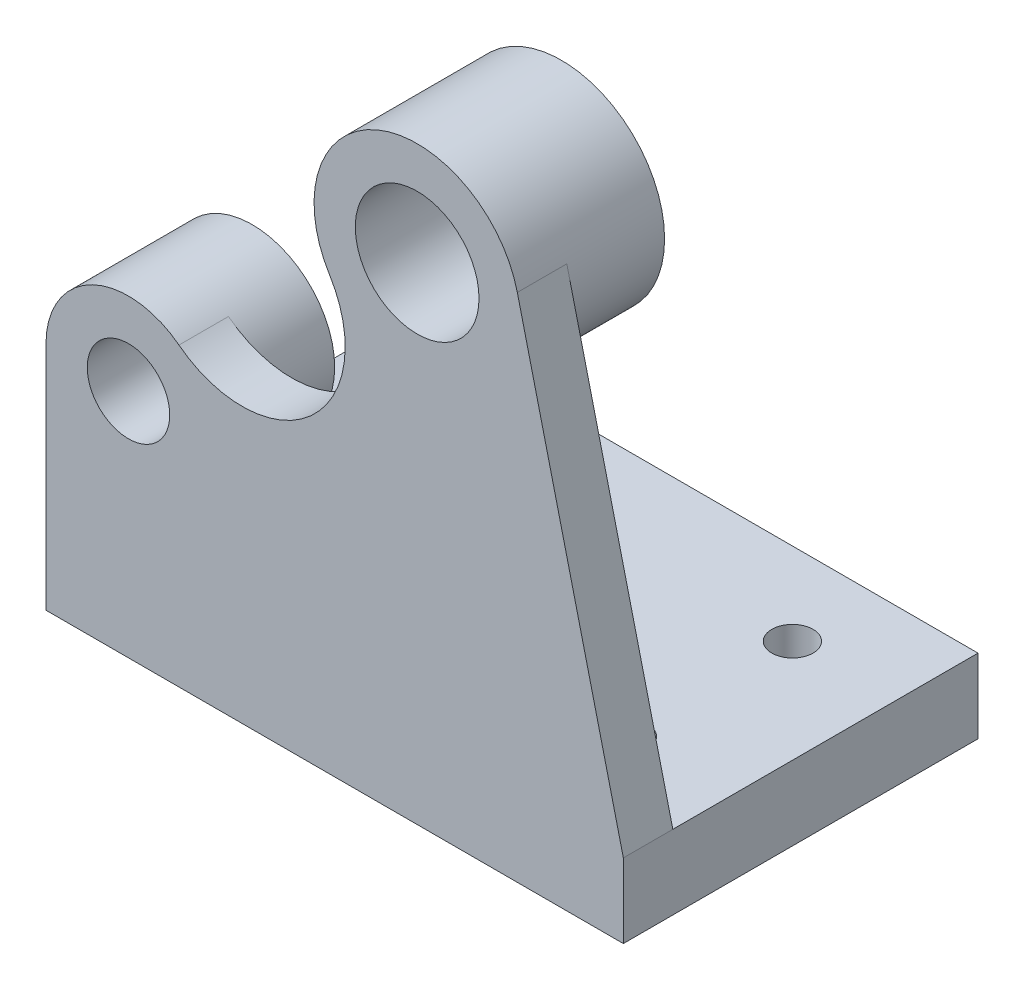
ISO-10303-21;
HEADER;
FILE_DESCRIPTION(('STEP AP214'),'2;1');
FILE_NAME('part.step','',(''),(''),'','','');
FILE_SCHEMA(('AUTOMOTIVE_DESIGN { 1 0 10303 214 1 1 1 1 }'));
ENDSEC;
DATA;
#1=APPLICATION_CONTEXT('core data for automotive mechanical design processes');
#2=APPLICATION_PROTOCOL_DEFINITION('international standard','automotive_design',2000,#1);
#3=PRODUCT_CONTEXT('',#1,'mechanical');
#4=PRODUCT('Part','Part','',(#3));
#5=PRODUCT_RELATED_PRODUCT_CATEGORY('part','',(#4));
#6=PRODUCT_DEFINITION_FORMATION('','',#4);
#7=PRODUCT_DEFINITION_CONTEXT('part definition',#1,'design');
#8=PRODUCT_DEFINITION('design','',#6,#7);
#9=PRODUCT_DEFINITION_SHAPE('','',#8);
#10=(LENGTH_UNIT() NAMED_UNIT(*) SI_UNIT(.MILLI.,.METRE.));
#11=(NAMED_UNIT(*) PLANE_ANGLE_UNIT() SI_UNIT($,.RADIAN.));
#12=(NAMED_UNIT(*) SI_UNIT($,.STERADIAN.) SOLID_ANGLE_UNIT());
#13=UNCERTAINTY_MEASURE_WITH_UNIT(LENGTH_MEASURE(1.E-05),#10,'distance_accuracy_value','');
#14=(GEOMETRIC_REPRESENTATION_CONTEXT(3) GLOBAL_UNCERTAINTY_ASSIGNED_CONTEXT((#13)) GLOBAL_UNIT_ASSIGNED_CONTEXT((#10,
#11,#12)) REPRESENTATION_CONTEXT('',''));
#15=CARTESIAN_POINT('',(0.,0.,0.));
#16=DIRECTION('',(0.,0.,1.));
#17=DIRECTION('',(1.,0.,0.));
#18=AXIS2_PLACEMENT_3D('',#15,#16,#17);
#19=CARTESIAN_POINT('',(45.,30.,17.));
#20=DIRECTION('',(0.,-1.,0.));
#21=DIRECTION('',(0.,0.,-1.));
#22=AXIS2_PLACEMENT_3D('',#19,#20,#21);
#23=CYLINDRICAL_SURFACE('',#22,5.);
#24=CARTESIAN_POINT('',(45.,18.,17.));
#25=DIRECTION('',(0.,1.,0.));
#26=DIRECTION('',(0.,0.,1.));
#27=AXIS2_PLACEMENT_3D('',#24,#25,#26);
#28=CIRCLE('',#27,5.);
#29=CARTESIAN_POINT('',(45.,18.,22.));
#30=VERTEX_POINT('',#29);
#31=EDGE_CURVE('E42',#30,#30,#28,.T.);
#32=ORIENTED_EDGE('',*,*,#31,.T.);
#33=EDGE_LOOP('',(#32));
#34=FACE_BOUND('',#33,.T.);
#35=CARTESIAN_POINT('',(45.,0.,17.));
#36=DIRECTION('',(0.,-1.,0.));
#37=DIRECTION('',(0.,0.,-1.));
#38=AXIS2_PLACEMENT_3D('',#35,#36,#37);
#39=CIRCLE('',#38,5.);
#40=CARTESIAN_POINT('',(45.,0.,12.));
#41=VERTEX_POINT('',#40);
#42=EDGE_CURVE('E11',#41,#41,#39,.T.);
#43=ORIENTED_EDGE('',*,*,#42,.T.);
#44=EDGE_LOOP('',(#43));
#45=FACE_BOUND('',#44,.T.);
#46=ADVANCED_FACE('F35',(#34,#45),#23,.F.);
#47=CARTESIAN_POINT('',(-55.,30.,17.));
#48=DIRECTION('',(0.,-1.,0.));
#49=DIRECTION('',(0.,0.,-1.));
#50=AXIS2_PLACEMENT_3D('',#47,#48,#49);
#51=CYLINDRICAL_SURFACE('',#50,5.);
#52=CARTESIAN_POINT('',(-55.,18.,17.));
#53=DIRECTION('',(0.,1.,0.));
#54=DIRECTION('',(0.,0.,1.));
#55=AXIS2_PLACEMENT_3D('',#52,#53,#54);
#56=CIRCLE('',#55,5.);
#57=CARTESIAN_POINT('',(-55.,18.,22.));
#58=VERTEX_POINT('',#57);
#59=EDGE_CURVE('E175',#58,#58,#56,.T.);
#60=ORIENTED_EDGE('',*,*,#59,.T.);
#61=EDGE_LOOP('',(#60));
#62=FACE_BOUND('',#61,.T.);
#63=CARTESIAN_POINT('',(-55.,0.,17.));
#64=DIRECTION('',(0.,-1.,0.));
#65=DIRECTION('',(0.,0.,-1.));
#66=AXIS2_PLACEMENT_3D('',#63,#64,#65);
#67=CIRCLE('',#66,5.);
#68=CARTESIAN_POINT('',(-55.,0.,12.));
#69=VERTEX_POINT('',#68);
#70=EDGE_CURVE('E178',#69,#69,#67,.T.);
#71=ORIENTED_EDGE('',*,*,#70,.T.);
#72=EDGE_LOOP('',(#71));
#73=FACE_BOUND('',#72,.T.);
#74=ADVANCED_FACE('F203',(#62,#73),#51,.F.);
#75=CARTESIAN_POINT('',(70.,18.,-43.));
#76=DIRECTION('',(-1.,0.,0.));
#77=DIRECTION('',(0.,0.,1.));
#78=AXIS2_PLACEMENT_3D('',#75,#76,#77);
#79=PLANE('',#78);
#80=DIRECTION('',(0.,0.,-1.));
#81=VECTOR('',#80,1.);
#82=CARTESIAN_POINT('',(70.,0.,-43.));
#83=LINE('',#82,#81);
#84=CARTESIAN_POINT('',(70.,0.,43.));
#85=VERTEX_POINT('',#84);
#86=CARTESIAN_POINT('',(70.,0.,-43.));
#87=VERTEX_POINT('',#86);
#88=EDGE_CURVE('E149',#85,#87,#83,.T.);
#89=ORIENTED_EDGE('',*,*,#88,.T.);
#90=DIRECTION('',(0.,-1.,0.));
#91=VECTOR('',#90,1.);
#92=CARTESIAN_POINT('',(70.,18.,-43.));
#93=LINE('',#92,#91);
#94=CARTESIAN_POINT('',(70.,18.,-43.));
#95=VERTEX_POINT('',#94);
#96=EDGE_CURVE('E172',#95,#87,#93,.T.);
#97=ORIENTED_EDGE('',*,*,#96,.F.);
#98=DIRECTION('',(0.,0.,-1.));
#99=VECTOR('',#98,1.);
#100=CARTESIAN_POINT('',(70.,18.,-43.));
#101=LINE('',#100,#99);
#102=CARTESIAN_POINT('',(70.,18.,31.));
#103=VERTEX_POINT('',#102);
#104=EDGE_CURVE('E78',#103,#95,#101,.T.);
#105=ORIENTED_EDGE('',*,*,#104,.F.);
#106=CARTESIAN_POINT('',(70.,18.,43.));
#107=VERTEX_POINT('',#106);
#108=EDGE_CURVE('E152',#107,#103,#101,.T.);
#109=ORIENTED_EDGE('',*,*,#108,.F.);
#110=DIRECTION('',(0.,-1.,0.));
#111=VECTOR('',#110,1.);
#112=CARTESIAN_POINT('',(70.,18.,43.));
#113=LINE('',#112,#111);
#114=EDGE_CURVE('E58',#107,#85,#113,.T.);
#115=ORIENTED_EDGE('',*,*,#114,.T.);
#116=EDGE_LOOP('',(#89,#97,#105,#109,#115));
#117=FACE_BOUND('',#116,.T.);
#118=ADVANCED_FACE('F207',(#117),#79,.F.);
#119=CARTESIAN_POINT('',(-70.,18.,-43.));
#120=DIRECTION('',(0.,0.,1.));
#121=DIRECTION('',(1.,0.,0.));
#122=AXIS2_PLACEMENT_3D('',#119,#120,#121);
#123=PLANE('',#122);
#124=DIRECTION('',(-1.,0.,0.));
#125=VECTOR('',#124,1.);
#126=CARTESIAN_POINT('',(-70.,0.,-43.));
#127=LINE('',#126,#125);
#128=CARTESIAN_POINT('',(-70.,0.,-43.));
#129=VERTEX_POINT('',#128);
#130=EDGE_CURVE('E161',#87,#129,#127,.T.);
#131=ORIENTED_EDGE('',*,*,#130,.T.);
#132=DIRECTION('',(0.,-1.,0.));
#133=VECTOR('',#132,1.);
#134=CARTESIAN_POINT('',(-70.,18.,-43.));
#135=LINE('',#134,#133);
#136=CARTESIAN_POINT('',(-70.,18.,-43.));
#137=VERTEX_POINT('',#136);
#138=EDGE_CURVE('E169',#137,#129,#135,.T.);
#139=ORIENTED_EDGE('',*,*,#138,.F.);
#140=DIRECTION('',(-1.,0.,0.));
#141=VECTOR('',#140,1.);
#142=CARTESIAN_POINT('',(-70.,18.,-43.));
#143=LINE('',#142,#141);
#144=EDGE_CURVE('E155',#95,#137,#143,.T.);
#145=ORIENTED_EDGE('',*,*,#144,.F.);
#146=ORIENTED_EDGE('',*,*,#96,.T.);
#147=EDGE_LOOP('',(#131,#139,#145,#146));
#148=FACE_BOUND('',#147,.T.);
#149=ADVANCED_FACE('F212',(#148),#123,.F.);
#150=CARTESIAN_POINT('',(-70.,18.,-43.));
#151=DIRECTION('',(1.,0.,0.));
#152=DIRECTION('',(0.,0.,-1.));
#153=AXIS2_PLACEMENT_3D('',#150,#151,#152);
#154=PLANE('',#153);
#155=DIRECTION('',(0.,0.,1.));
#156=VECTOR('',#155,1.);
#157=CARTESIAN_POINT('',(-70.,0.,-43.));
#158=LINE('',#157,#156);
#159=CARTESIAN_POINT('',(-70.,0.,43.));
#160=VERTEX_POINT('',#159);
#161=EDGE_CURVE('E163',#129,#160,#158,.T.);
#162=ORIENTED_EDGE('',*,*,#161,.T.);
#163=DIRECTION('',(0.,-1.,0.));
#164=VECTOR('',#163,1.);
#165=CARTESIAN_POINT('',(-70.,18.,43.));
#166=LINE('',#165,#164);
#167=CARTESIAN_POINT('',(-70.,56.,43.));
#168=VERTEX_POINT('',#167);
#169=EDGE_CURVE('E167',#168,#160,#166,.T.);
#170=ORIENTED_EDGE('',*,*,#169,.F.);
#171=DIRECTION('',(0.,0.,1.));
#172=VECTOR('',#171,1.);
#173=CARTESIAN_POINT('',(-70.,56.,31.));
#174=LINE('',#173,#172);
#175=CARTESIAN_POINT('',(-70.,56.,31.));
#176=VERTEX_POINT('',#175);
#177=EDGE_CURVE('E114',#176,#168,#174,.T.);
#178=ORIENTED_EDGE('',*,*,#177,.F.);
#179=DIRECTION('',(0.,-1.,0.));
#180=VECTOR('',#179,1.);
#181=CARTESIAN_POINT('',(-70.,0.,31.));
#182=LINE('',#181,#180);
#183=CARTESIAN_POINT('',(-70.,18.,31.));
#184=VERTEX_POINT('',#183);
#185=EDGE_CURVE('E247',#176,#184,#182,.T.);
#186=ORIENTED_EDGE('',*,*,#185,.T.);
#187=DIRECTION('',(0.,0.,1.));
#188=VECTOR('',#187,1.);
#189=CARTESIAN_POINT('',(-70.,18.,-43.));
#190=LINE('',#189,#188);
#191=EDGE_CURVE('E157',#137,#184,#190,.T.);
#192=ORIENTED_EDGE('',*,*,#191,.F.);
#193=ORIENTED_EDGE('',*,*,#138,.T.);
#194=EDGE_LOOP('',(#162,#170,#178,#186,#192,#193));
#195=FACE_BOUND('',#194,.T.);
#196=ADVANCED_FACE('F197',(#195),#154,.F.);
#197=CARTESIAN_POINT('',(-70.,18.,43.));
#198=DIRECTION('',(0.,0.,-1.));
#199=DIRECTION('',(-1.,0.,0.));
#200=AXIS2_PLACEMENT_3D('',#197,#198,#199);
#201=PLANE('',#200);
#202=DIRECTION('',(1.,0.,0.));
#203=VECTOR('',#202,1.);
#204=CARTESIAN_POINT('',(-70.,0.,43.));
#205=LINE('',#204,#203);
#206=EDGE_CURVE('E77',#160,#85,#205,.T.);
#207=ORIENTED_EDGE('',*,*,#206,.T.);
#208=ORIENTED_EDGE('',*,*,#114,.F.);
#209=DIRECTION('',(-0.235889894354067,0.971779788708135,0.));
#210=VECTOR('',#209,1.);
#211=CARTESIAN_POINT('',(70.2311116124019,17.0479049792153,43.));
#212=LINE('',#211,#210);
#213=CARTESIAN_POINT('',(44.2944947177034,123.897247358852,43.));
#214=VERTEX_POINT('',#213);
#215=EDGE_CURVE('E134',#107,#214,#212,.T.);
#216=ORIENTED_EDGE('',*,*,#215,.T.);
#217=CARTESIAN_POINT('',(20.,118.,43.));
#218=DIRECTION('',(0.,0.,1.));
#219=DIRECTION('',(1.,0.,0.));
#220=AXIS2_PLACEMENT_3D('',#217,#218,#219);
#221=CIRCLE('',#220,25.);
#222=CARTESIAN_POINT('',(-1.22530085264707,104.790662252989,43.));
#223=VERTEX_POINT('',#222);
#224=EDGE_CURVE('E133',#214,#223,#221,.T.);
#225=ORIENTED_EDGE('',*,*,#224,.T.);
#226=CARTESIAN_POINT('',(-22.4506017052942,91.5813245059772,43.));
#227=DIRECTION('',(0.,0.,1.));
#228=DIRECTION('',(1.,0.,0.));
#229=AXIS2_PLACEMENT_3D('',#226,#227,#228);
#230=CIRCLE('',#229,25.);
#231=CARTESIAN_POINT('',(-37.7558229801307,71.8139220026566,43.));
#232=VERTEX_POINT('',#231);
#233=EDGE_CURVE('E125',#223,#232,#230,.F.);
#234=ORIENTED_EDGE('',*,*,#233,.T.);
#235=CARTESIAN_POINT('',(-50.,56.,43.));
#236=DIRECTION('',(0.,0.,1.));
#237=DIRECTION('',(1.,0.,0.));
#238=AXIS2_PLACEMENT_3D('',#235,#236,#237);
#239=CIRCLE('',#238,20.);
#240=EDGE_CURVE('E107',#232,#168,#239,.T.);
#241=ORIENTED_EDGE('',*,*,#240,.T.);
#242=ORIENTED_EDGE('',*,*,#169,.T.);
#243=EDGE_LOOP('',(#207,#208,#216,#225,#234,#241,#242));
#244=FACE_BOUND('',#243,.T.);
#245=CARTESIAN_POINT('',(20.,118.,43.));
#246=DIRECTION('',(0.,0.,1.));
#247=DIRECTION('',(1.,0.,0.));
#248=AXIS2_PLACEMENT_3D('',#245,#246,#247);
#249=CIRCLE('',#248,15.);
#250=CARTESIAN_POINT('',(35.,118.,43.));
#251=VERTEX_POINT('',#250);
#252=EDGE_CURVE('E252',#251,#251,#249,.T.);
#253=ORIENTED_EDGE('',*,*,#252,.F.);
#254=EDGE_LOOP('',(#253));
#255=FACE_BOUND('',#254,.T.);
#256=CARTESIAN_POINT('',(-50.,56.,43.));
#257=DIRECTION('',(0.,0.,1.));
#258=DIRECTION('',(1.,0.,0.));
#259=AXIS2_PLACEMENT_3D('',#256,#257,#258);
#260=CIRCLE('',#259,10.);
#261=CARTESIAN_POINT('',(-40.,56.,43.));
#262=VERTEX_POINT('',#261);
#263=EDGE_CURVE('E118',#262,#262,#260,.T.);
#264=ORIENTED_EDGE('',*,*,#263,.F.);
#265=EDGE_LOOP('',(#264));
#266=FACE_BOUND('',#265,.T.);
#267=ADVANCED_FACE('F131',(#244,#255,#266),#201,.F.);
#268=CARTESIAN_POINT('',(0.,18.,0.));
#269=DIRECTION('',(0.,1.,0.));
#270=DIRECTION('',(0.,0.,1.));
#271=AXIS2_PLACEMENT_3D('',#268,#269,#270);
#272=PLANE('',#271);
#273=CARTESIAN_POINT('',(45.,18.,-23.));
#274=DIRECTION('',(0.,1.,0.));
#275=DIRECTION('',(0.,0.,1.));
#276=AXIS2_PLACEMENT_3D('',#273,#274,#275);
#277=CIRCLE('',#276,5.);
#278=CARTESIAN_POINT('',(45.,18.,-18.));
#279=VERTEX_POINT('',#278);
#280=EDGE_CURVE('E273',#279,#279,#277,.T.);
#281=ORIENTED_EDGE('',*,*,#280,.F.);
#282=EDGE_LOOP('',(#281));
#283=FACE_BOUND('',#282,.T.);
#284=CARTESIAN_POINT('',(-55.,18.,-23.));
#285=DIRECTION('',(0.,1.,0.));
#286=DIRECTION('',(0.,0.,1.));
#287=AXIS2_PLACEMENT_3D('',#284,#285,#286);
#288=CIRCLE('',#287,5.);
#289=CARTESIAN_POINT('',(-55.,18.,-18.));
#290=VERTEX_POINT('',#289);
#291=EDGE_CURVE('E260',#290,#290,#288,.T.);
#292=ORIENTED_EDGE('',*,*,#291,.F.);
#293=EDGE_LOOP('',(#292));
#294=FACE_BOUND('',#293,.T.);
#295=DIRECTION('',(-1.,0.,0.));
#296=VECTOR('',#295,1.);
#297=CARTESIAN_POINT('',(0.,18.,31.));
#298=LINE('',#297,#296);
#299=EDGE_CURVE('E49',#103,#184,#298,.T.);
#300=ORIENTED_EDGE('',*,*,#299,.F.);
#301=ORIENTED_EDGE('',*,*,#104,.T.);
#302=ORIENTED_EDGE('',*,*,#144,.T.);
#303=ORIENTED_EDGE('',*,*,#191,.T.);
#304=EDGE_LOOP('',(#300,#301,#302,#303));
#305=FACE_BOUND('',#304,.T.);
#306=ORIENTED_EDGE('',*,*,#59,.F.);
#307=EDGE_LOOP('',(#306));
#308=FACE_BOUND('',#307,.T.);
#309=ORIENTED_EDGE('',*,*,#31,.F.);
#310=EDGE_LOOP('',(#309));
#311=FACE_BOUND('',#310,.T.);
#312=ADVANCED_FACE('F185',(#283,#294,#305,#308,#311),#272,.T.);
#313=CARTESIAN_POINT('',(0.,0.,0.));
#314=DIRECTION('',(0.,1.,0.));
#315=DIRECTION('',(0.,0.,1.));
#316=AXIS2_PLACEMENT_3D('',#313,#314,#315);
#317=PLANE('',#316);
#318=CARTESIAN_POINT('',(45.,0.,-23.));
#319=DIRECTION('',(0.,-1.,0.));
#320=DIRECTION('',(0.,0.,-1.));
#321=AXIS2_PLACEMENT_3D('',#318,#319,#320);
#322=CIRCLE('',#321,5.);
#323=CARTESIAN_POINT('',(45.,0.,-28.));
#324=VERTEX_POINT('',#323);
#325=EDGE_CURVE('E270',#324,#324,#322,.T.);
#326=ORIENTED_EDGE('',*,*,#325,.F.);
#327=EDGE_LOOP('',(#326));
#328=FACE_BOUND('',#327,.T.);
#329=CARTESIAN_POINT('',(-55.,0.,-23.));
#330=DIRECTION('',(0.,-1.,0.));
#331=DIRECTION('',(0.,0.,-1.));
#332=AXIS2_PLACEMENT_3D('',#329,#330,#331);
#333=CIRCLE('',#332,5.);
#334=CARTESIAN_POINT('',(-55.,0.,-28.));
#335=VERTEX_POINT('',#334);
#336=EDGE_CURVE('E267',#335,#335,#333,.T.);
#337=ORIENTED_EDGE('',*,*,#336,.F.);
#338=EDGE_LOOP('',(#337));
#339=FACE_BOUND('',#338,.T.);
#340=ORIENTED_EDGE('',*,*,#88,.F.);
#341=ORIENTED_EDGE('',*,*,#206,.F.);
#342=ORIENTED_EDGE('',*,*,#161,.F.);
#343=ORIENTED_EDGE('',*,*,#130,.F.);
#344=EDGE_LOOP('',(#340,#341,#342,#343));
#345=FACE_BOUND('',#344,.T.);
#346=ORIENTED_EDGE('',*,*,#70,.F.);
#347=EDGE_LOOP('',(#346));
#348=FACE_BOUND('',#347,.T.);
#349=ORIENTED_EDGE('',*,*,#42,.F.);
#350=EDGE_LOOP('',(#349));
#351=FACE_BOUND('',#350,.T.);
#352=ADVANCED_FACE('F187',(#328,#339,#345,#348,#351),#317,.F.);
#353=CARTESIAN_POINT('',(70.2311116124019,17.0479049792153,31.));
#354=DIRECTION('',(0.971779788708135,0.235889894354067,0.));
#355=DIRECTION('',(-0.235889894354067,0.971779788708135,0.));
#356=AXIS2_PLACEMENT_3D('',#353,#354,#355);
#357=PLANE('',#356);
#358=ORIENTED_EDGE('',*,*,#215,.F.);
#359=ORIENTED_EDGE('',*,*,#108,.T.);
#360=DIRECTION('',(-0.235889894354067,0.971779788708135,0.));
#361=VECTOR('',#360,1.);
#362=CARTESIAN_POINT('',(70.2311116124019,17.0479049792153,31.));
#363=LINE('',#362,#361);
#364=CARTESIAN_POINT('',(44.2944947177034,123.897247358852,31.));
#365=VERTEX_POINT('',#364);
#366=EDGE_CURVE('E143',#103,#365,#363,.T.);
#367=ORIENTED_EDGE('',*,*,#366,.T.);
#368=DIRECTION('',(0.,0.,1.));
#369=VECTOR('',#368,1.);
#370=CARTESIAN_POINT('',(44.2944947177034,123.897247358852,31.));
#371=LINE('',#370,#369);
#372=EDGE_CURVE('E146',#365,#214,#371,.T.);
#373=ORIENTED_EDGE('',*,*,#372,.T.);
#374=EDGE_LOOP('',(#358,#359,#367,#373));
#375=FACE_BOUND('',#374,.T.);
#376=ADVANCED_FACE('F194',(#375),#357,.T.);
#377=CARTESIAN_POINT('',(-22.4506017052942,91.5813245059772,31.));
#378=DIRECTION('',(0.,0.,1.));
#379=DIRECTION('',(1.,0.,0.));
#380=AXIS2_PLACEMENT_3D('',#377,#378,#379);
#381=CYLINDRICAL_SURFACE('',#380,25.);
#382=ORIENTED_EDGE('',*,*,#233,.F.);
#383=DIRECTION('',(0.,0.,1.));
#384=VECTOR('',#383,1.);
#385=CARTESIAN_POINT('',(-1.22530085264707,104.790662252989,31.));
#386=LINE('',#385,#384);
#387=CARTESIAN_POINT('',(-1.22530085264706,104.790662252989,31.));
#388=VERTEX_POINT('',#387);
#389=EDGE_CURVE('E128',#388,#223,#386,.T.);
#390=ORIENTED_EDGE('',*,*,#389,.F.);
#391=CARTESIAN_POINT('',(-22.4506017052942,91.5813245059772,31.));
#392=DIRECTION('',(0.,0.,1.));
#393=DIRECTION('',(1.,0.,0.));
#394=AXIS2_PLACEMENT_3D('',#391,#392,#393);
#395=CIRCLE('',#394,25.);
#396=CARTESIAN_POINT('',(-37.7558229801307,71.8139220026566,31.));
#397=VERTEX_POINT('',#396);
#398=EDGE_CURVE('E127',#388,#397,#395,.F.);
#399=ORIENTED_EDGE('',*,*,#398,.T.);
#400=DIRECTION('',(0.,0.,1.));
#401=VECTOR('',#400,1.);
#402=CARTESIAN_POINT('',(-37.7558229801307,71.8139220026566,31.));
#403=LINE('',#402,#401);
#404=EDGE_CURVE('E111',#397,#232,#403,.T.);
#405=ORIENTED_EDGE('',*,*,#404,.T.);
#406=EDGE_LOOP('',(#382,#390,#399,#405));
#407=FACE_BOUND('',#406,.T.);
#408=ADVANCED_FACE('F123',(#407),#381,.F.);
#409=CARTESIAN_POINT('',(0.,0.,31.));
#410=DIRECTION('',(0.,0.,1.));
#411=DIRECTION('',(1.,0.,0.));
#412=AXIS2_PLACEMENT_3D('',#409,#410,#411);
#413=PLANE('',#412);
#414=CARTESIAN_POINT('',(20.,118.,31.));
#415=DIRECTION('',(0.,0.,1.));
#416=DIRECTION('',(1.,0.,0.));
#417=AXIS2_PLACEMENT_3D('',#414,#415,#416);
#418=CIRCLE('',#417,25.);
#419=EDGE_CURVE('E137',#388,#365,#418,.T.);
#420=ORIENTED_EDGE('',*,*,#419,.T.);
#421=ORIENTED_EDGE('',*,*,#366,.F.);
#422=ORIENTED_EDGE('',*,*,#299,.T.);
#423=ORIENTED_EDGE('',*,*,#185,.F.);
#424=CARTESIAN_POINT('',(-50.,56.,31.));
#425=DIRECTION('',(0.,0.,1.));
#426=DIRECTION('',(1.,0.,0.));
#427=AXIS2_PLACEMENT_3D('',#424,#425,#426);
#428=CIRCLE('',#427,20.);
#429=EDGE_CURVE('E241',#176,#397,#428,.T.);
#430=ORIENTED_EDGE('',*,*,#429,.T.);
#431=ORIENTED_EDGE('',*,*,#398,.F.);
#432=EDGE_LOOP('',(#420,#421,#422,#423,#430,#431));
#433=FACE_BOUND('',#432,.T.);
#434=ADVANCED_FACE('F239',(#433),#413,.F.);
#435=CARTESIAN_POINT('',(20.,118.,7.99999999999999));
#436=DIRECTION('',(0.,0.,1.));
#437=DIRECTION('',(1.,0.,0.));
#438=AXIS2_PLACEMENT_3D('',#435,#436,#437);
#439=CYLINDRICAL_SURFACE('',#438,25.);
#440=CARTESIAN_POINT('',(20.,118.,7.99999999999999));
#441=DIRECTION('',(0.,0.,1.));
#442=DIRECTION('',(1.,0.,0.));
#443=AXIS2_PLACEMENT_3D('',#440,#441,#442);
#444=CIRCLE('',#443,25.);
#445=CARTESIAN_POINT('',(45.,118.,7.99999999999999));
#446=VERTEX_POINT('',#445);
#447=EDGE_CURVE('E135',#446,#446,#444,.T.);
#448=ORIENTED_EDGE('',*,*,#447,.T.);
#449=EDGE_LOOP('',(#448));
#450=FACE_BOUND('',#449,.T.);
#451=ORIENTED_EDGE('',*,*,#372,.F.);
#452=ORIENTED_EDGE('',*,*,#419,.F.);
#453=ORIENTED_EDGE('',*,*,#389,.T.);
#454=ORIENTED_EDGE('',*,*,#224,.F.);
#455=EDGE_LOOP('',(#451,#452,#453,#454));
#456=FACE_BOUND('',#455,.T.);
#457=ADVANCED_FACE('F237',(#450,#456),#439,.T.);
#458=CARTESIAN_POINT('',(20.,118.,7.99999999999999));
#459=DIRECTION('',(0.,0.,1.));
#460=DIRECTION('',(1.,0.,0.));
#461=AXIS2_PLACEMENT_3D('',#458,#459,#460);
#462=CYLINDRICAL_SURFACE('',#461,15.);
#463=CARTESIAN_POINT('',(20.,118.,7.99999999999999));
#464=DIRECTION('',(0.,0.,1.));
#465=DIRECTION('',(1.,0.,0.));
#466=AXIS2_PLACEMENT_3D('',#463,#464,#465);
#467=CIRCLE('',#466,15.);
#468=CARTESIAN_POINT('',(35.,118.,7.99999999999999));
#469=VERTEX_POINT('',#468);
#470=EDGE_CURVE('E140',#469,#469,#467,.T.);
#471=ORIENTED_EDGE('',*,*,#470,.F.);
#472=EDGE_LOOP('',(#471));
#473=FACE_BOUND('',#472,.T.);
#474=ORIENTED_EDGE('',*,*,#252,.T.);
#475=EDGE_LOOP('',(#474));
#476=FACE_BOUND('',#475,.T.);
#477=ADVANCED_FACE('F304',(#473,#476),#462,.F.);
#478=CARTESIAN_POINT('',(0.,0.,7.99999999999999));
#479=DIRECTION('',(0.,0.,1.));
#480=DIRECTION('',(1.,0.,0.));
#481=AXIS2_PLACEMENT_3D('',#478,#479,#480);
#482=PLANE('',#481);
#483=ORIENTED_EDGE('',*,*,#470,.T.);
#484=EDGE_LOOP('',(#483));
#485=FACE_BOUND('',#484,.T.);
#486=ORIENTED_EDGE('',*,*,#447,.F.);
#487=EDGE_LOOP('',(#486));
#488=FACE_BOUND('',#487,.T.);
#489=ADVANCED_FACE('F300',(#485,#488),#482,.F.);
#490=CARTESIAN_POINT('',(-50.,56.,13.));
#491=DIRECTION('',(0.,0.,1.));
#492=DIRECTION('',(1.,0.,0.));
#493=AXIS2_PLACEMENT_3D('',#490,#491,#492);
#494=CYLINDRICAL_SURFACE('',#493,10.);
#495=CARTESIAN_POINT('',(-50.,56.,13.));
#496=DIRECTION('',(0.,0.,1.));
#497=DIRECTION('',(1.,0.,0.));
#498=AXIS2_PLACEMENT_3D('',#495,#496,#497);
#499=CIRCLE('',#498,10.);
#500=CARTESIAN_POINT('',(-40.,56.,13.));
#501=VERTEX_POINT('',#500);
#502=EDGE_CURVE('E117',#501,#501,#499,.T.);
#503=ORIENTED_EDGE('',*,*,#502,.F.);
#504=EDGE_LOOP('',(#503));
#505=FACE_BOUND('',#504,.T.);
#506=ORIENTED_EDGE('',*,*,#263,.T.);
#507=EDGE_LOOP('',(#506));
#508=FACE_BOUND('',#507,.T.);
#509=ADVANCED_FACE('F297',(#505,#508),#494,.F.);
#510=CARTESIAN_POINT('',(-50.,56.,13.));
#511=DIRECTION('',(0.,0.,1.));
#512=DIRECTION('',(1.,0.,0.));
#513=AXIS2_PLACEMENT_3D('',#510,#511,#512);
#514=CYLINDRICAL_SURFACE('',#513,20.);
#515=ORIENTED_EDGE('',*,*,#429,.F.);
#516=ORIENTED_EDGE('',*,*,#177,.T.);
#517=ORIENTED_EDGE('',*,*,#240,.F.);
#518=ORIENTED_EDGE('',*,*,#404,.F.);
#519=EDGE_LOOP('',(#515,#516,#517,#518));
#520=FACE_BOUND('',#519,.T.);
#521=CARTESIAN_POINT('',(-50.,56.,13.));
#522=DIRECTION('',(0.,0.,1.));
#523=DIRECTION('',(1.,0.,0.));
#524=AXIS2_PLACEMENT_3D('',#521,#522,#523);
#525=CIRCLE('',#524,20.);
#526=CARTESIAN_POINT('',(-30.,56.,13.));
#527=VERTEX_POINT('',#526);
#528=EDGE_CURVE('E254',#527,#527,#525,.T.);
#529=ORIENTED_EDGE('',*,*,#528,.T.);
#530=EDGE_LOOP('',(#529));
#531=FACE_BOUND('',#530,.T.);
#532=ADVANCED_FACE('F109',(#520,#531),#514,.T.);
#533=CARTESIAN_POINT('',(0.,0.,13.));
#534=DIRECTION('',(0.,0.,1.));
#535=DIRECTION('',(1.,0.,0.));
#536=AXIS2_PLACEMENT_3D('',#533,#534,#535);
#537=PLANE('',#536);
#538=ORIENTED_EDGE('',*,*,#502,.T.);
#539=EDGE_LOOP('',(#538));
#540=FACE_BOUND('',#539,.T.);
#541=ORIENTED_EDGE('',*,*,#528,.F.);
#542=EDGE_LOOP('',(#541));
#543=FACE_BOUND('',#542,.T.);
#544=ADVANCED_FACE('F286',(#540,#543),#537,.F.);
#545=CARTESIAN_POINT('',(-55.,30.,-23.));
#546=DIRECTION('',(0.,-1.,0.));
#547=DIRECTION('',(0.,0.,-1.));
#548=AXIS2_PLACEMENT_3D('',#545,#546,#547);
#549=CYLINDRICAL_SURFACE('',#548,5.);
#550=ORIENTED_EDGE('',*,*,#291,.T.);
#551=EDGE_LOOP('',(#550));
#552=FACE_BOUND('',#551,.T.);
#553=ORIENTED_EDGE('',*,*,#336,.T.);
#554=EDGE_LOOP('',(#553));
#555=FACE_BOUND('',#554,.T.);
#556=ADVANCED_FACE('F279',(#552,#555),#549,.F.);
#557=CARTESIAN_POINT('',(45.,30.,-23.));
#558=DIRECTION('',(0.,-1.,0.));
#559=DIRECTION('',(0.,0.,-1.));
#560=AXIS2_PLACEMENT_3D('',#557,#558,#559);
#561=CYLINDRICAL_SURFACE('',#560,5.);
#562=ORIENTED_EDGE('',*,*,#280,.T.);
#563=EDGE_LOOP('',(#562));
#564=FACE_BOUND('',#563,.T.);
#565=ORIENTED_EDGE('',*,*,#325,.T.);
#566=EDGE_LOOP('',(#565));
#567=FACE_BOUND('',#566,.T.);
#568=ADVANCED_FACE('F276',(#564,#567),#561,.F.);
#569=CLOSED_SHELL('',(#46,#74,#118,#149,#196,#267,#312,#352,#376,#408,#434,#457,#477,#489,#509,
#532,#544,#556,#568));
#570=MANIFOLD_SOLID_BREP('B2',#569);
#571=ADVANCED_BREP_SHAPE_REPRESENTATION('',(#18,#570),#14);
#572=SHAPE_DEFINITION_REPRESENTATION(#9,#571);
ENDSEC;
END-ISO-10303-21;
